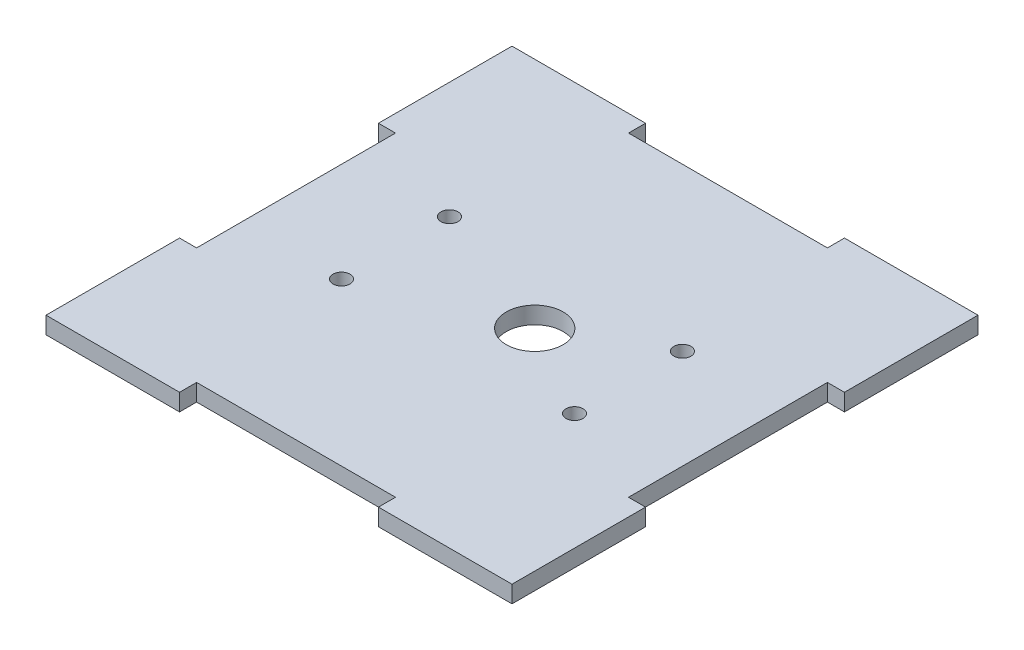
ISO-10303-21;
HEADER;
FILE_DESCRIPTION(('STEP AP214'),'2;1');
FILE_NAME('part.step','',(''),(''),'','','');
FILE_SCHEMA(('AUTOMOTIVE_DESIGN { 1 0 10303 214 1 1 1 1 }'));
ENDSEC;
DATA;
#1=APPLICATION_CONTEXT('core data for automotive mechanical design processes');
#2=APPLICATION_PROTOCOL_DEFINITION('international standard','automotive_design',2000,#1);
#3=PRODUCT_CONTEXT('',#1,'mechanical');
#4=PRODUCT('Part','Part','',(#3));
#5=PRODUCT_RELATED_PRODUCT_CATEGORY('part','',(#4));
#6=PRODUCT_DEFINITION_FORMATION('','',#4);
#7=PRODUCT_DEFINITION_CONTEXT('part definition',#1,'design');
#8=PRODUCT_DEFINITION('design','',#6,#7);
#9=PRODUCT_DEFINITION_SHAPE('','',#8);
#10=(LENGTH_UNIT() NAMED_UNIT(*) SI_UNIT(.MILLI.,.METRE.));
#11=(NAMED_UNIT(*) PLANE_ANGLE_UNIT() SI_UNIT($,.RADIAN.));
#12=(NAMED_UNIT(*) SI_UNIT($,.STERADIAN.) SOLID_ANGLE_UNIT());
#13=UNCERTAINTY_MEASURE_WITH_UNIT(LENGTH_MEASURE(1.E-05),#10,'distance_accuracy_value','');
#14=(GEOMETRIC_REPRESENTATION_CONTEXT(3) GLOBAL_UNCERTAINTY_ASSIGNED_CONTEXT((#13)) GLOBAL_UNIT_ASSIGNED_CONTEXT((#10,
#11,#12)) REPRESENTATION_CONTEXT('',''));
#15=CARTESIAN_POINT('',(0.,0.,0.));
#16=DIRECTION('',(0.,0.,1.));
#17=DIRECTION('',(1.,0.,0.));
#18=AXIS2_PLACEMENT_3D('',#15,#16,#17);
#19=CARTESIAN_POINT('',(41.,3.,-17.5));
#20=DIRECTION('',(-1.,0.,0.));
#21=DIRECTION('',(0.,0.,1.));
#22=AXIS2_PLACEMENT_3D('',#19,#20,#21);
#23=PLANE('',#22);
#24=DIRECTION('',(0.,0.,-1.));
#25=VECTOR('',#24,1.);
#26=CARTESIAN_POINT('',(41.,0.,-17.5));
#27=LINE('',#26,#25);
#28=CARTESIAN_POINT('',(41.,0.,-17.5));
#29=VERTEX_POINT('',#28);
#30=CARTESIAN_POINT('',(41.,0.,-41.));
#31=VERTEX_POINT('',#30);
#32=EDGE_CURVE('E211',#29,#31,#27,.T.);
#33=ORIENTED_EDGE('',*,*,#32,.T.);
#34=DIRECTION('',(0.,-1.,0.));
#35=VECTOR('',#34,1.);
#36=CARTESIAN_POINT('',(41.,3.,-41.));
#37=LINE('',#36,#35);
#38=CARTESIAN_POINT('',(41.,3.,-41.));
#39=VERTEX_POINT('',#38);
#40=EDGE_CURVE('E11',#39,#31,#37,.T.);
#41=ORIENTED_EDGE('',*,*,#40,.F.);
#42=DIRECTION('',(0.,0.,-1.));
#43=VECTOR('',#42,1.);
#44=CARTESIAN_POINT('',(41.,3.,-17.5));
#45=LINE('',#44,#43);
#46=CARTESIAN_POINT('',(41.,3.,-17.5));
#47=VERTEX_POINT('',#46);
#48=EDGE_CURVE('E270',#47,#39,#45,.T.);
#49=ORIENTED_EDGE('',*,*,#48,.F.);
#50=DIRECTION('',(0.,-1.,0.));
#51=VECTOR('',#50,1.);
#52=CARTESIAN_POINT('',(41.,3.,-17.5));
#53=LINE('',#52,#51);
#54=EDGE_CURVE('E207',#47,#29,#53,.T.);
#55=ORIENTED_EDGE('',*,*,#54,.T.);
#56=EDGE_LOOP('',(#33,#41,#49,#55));
#57=FACE_BOUND('',#56,.T.);
#58=ADVANCED_FACE('F38',(#57),#23,.F.);
#59=CARTESIAN_POINT('',(17.5,3.,-41.));
#60=DIRECTION('',(0.,0.,1.));
#61=DIRECTION('',(1.,0.,0.));
#62=AXIS2_PLACEMENT_3D('',#59,#60,#61);
#63=PLANE('',#62);
#64=DIRECTION('',(-1.,0.,0.));
#65=VECTOR('',#64,1.);
#66=CARTESIAN_POINT('',(17.5,0.,-41.));
#67=LINE('',#66,#65);
#68=CARTESIAN_POINT('',(17.5,0.,-41.));
#69=VERTEX_POINT('',#68);
#70=EDGE_CURVE('E215',#31,#69,#67,.T.);
#71=ORIENTED_EDGE('',*,*,#70,.T.);
#72=DIRECTION('',(0.,-1.,0.));
#73=VECTOR('',#72,1.);
#74=CARTESIAN_POINT('',(17.5,3.,-41.));
#75=LINE('',#74,#73);
#76=CARTESIAN_POINT('',(17.5,3.,-41.));
#77=VERTEX_POINT('',#76);
#78=EDGE_CURVE('E47',#77,#69,#75,.T.);
#79=ORIENTED_EDGE('',*,*,#78,.F.);
#80=DIRECTION('',(-1.,0.,0.));
#81=VECTOR('',#80,1.);
#82=CARTESIAN_POINT('',(17.5,3.,-41.));
#83=LINE('',#82,#81);
#84=EDGE_CURVE('E134',#39,#77,#83,.T.);
#85=ORIENTED_EDGE('',*,*,#84,.F.);
#86=ORIENTED_EDGE('',*,*,#40,.T.);
#87=EDGE_LOOP('',(#71,#79,#85,#86));
#88=FACE_BOUND('',#87,.T.);
#89=ADVANCED_FACE('F421',(#88),#63,.F.);
#90=CARTESIAN_POINT('',(17.5,3.,-38.));
#91=DIRECTION('',(1.,0.,0.));
#92=DIRECTION('',(0.,0.,-1.));
#93=AXIS2_PLACEMENT_3D('',#90,#91,#92);
#94=PLANE('',#93);
#95=DIRECTION('',(0.,0.,1.));
#96=VECTOR('',#95,1.);
#97=CARTESIAN_POINT('',(17.5,0.,-38.));
#98=LINE('',#97,#96);
#99=CARTESIAN_POINT('',(17.5,0.,-38.));
#100=VERTEX_POINT('',#99);
#101=EDGE_CURVE('E219',#69,#100,#98,.T.);
#102=ORIENTED_EDGE('',*,*,#101,.T.);
#103=DIRECTION('',(0.,-1.,0.));
#104=VECTOR('',#103,1.);
#105=CARTESIAN_POINT('',(17.5,3.,-38.));
#106=LINE('',#105,#104);
#107=CARTESIAN_POINT('',(17.5,3.,-38.));
#108=VERTEX_POINT('',#107);
#109=EDGE_CURVE('E329',#108,#100,#106,.T.);
#110=ORIENTED_EDGE('',*,*,#109,.F.);
#111=DIRECTION('',(0.,0.,1.));
#112=VECTOR('',#111,1.);
#113=CARTESIAN_POINT('',(17.5,3.,-38.));
#114=LINE('',#113,#112);
#115=EDGE_CURVE('E339',#77,#108,#114,.T.);
#116=ORIENTED_EDGE('',*,*,#115,.F.);
#117=ORIENTED_EDGE('',*,*,#78,.T.);
#118=EDGE_LOOP('',(#102,#110,#116,#117));
#119=FACE_BOUND('',#118,.T.);
#120=ADVANCED_FACE('F337',(#119),#94,.F.);
#121=CARTESIAN_POINT('',(-17.5,3.,-38.));
#122=DIRECTION('',(0.,0.,1.));
#123=DIRECTION('',(1.,0.,0.));
#124=AXIS2_PLACEMENT_3D('',#121,#122,#123);
#125=PLANE('',#124);
#126=DIRECTION('',(-1.,0.,0.));
#127=VECTOR('',#126,1.);
#128=CARTESIAN_POINT('',(-17.5,0.,-38.));
#129=LINE('',#128,#127);
#130=CARTESIAN_POINT('',(-17.5,0.,-38.));
#131=VERTEX_POINT('',#130);
#132=EDGE_CURVE('E222',#100,#131,#129,.T.);
#133=ORIENTED_EDGE('',*,*,#132,.T.);
#134=DIRECTION('',(0.,-1.,0.));
#135=VECTOR('',#134,1.);
#136=CARTESIAN_POINT('',(-17.5,3.,-38.));
#137=LINE('',#136,#135);
#138=CARTESIAN_POINT('',(-17.5,3.,-38.));
#139=VERTEX_POINT('',#138);
#140=EDGE_CURVE('E325',#139,#131,#137,.T.);
#141=ORIENTED_EDGE('',*,*,#140,.F.);
#142=DIRECTION('',(-1.,0.,0.));
#143=VECTOR('',#142,1.);
#144=CARTESIAN_POINT('',(-17.5,3.,-38.));
#145=LINE('',#144,#143);
#146=EDGE_CURVE('E358',#108,#139,#145,.T.);
#147=ORIENTED_EDGE('',*,*,#146,.F.);
#148=ORIENTED_EDGE('',*,*,#109,.T.);
#149=EDGE_LOOP('',(#133,#141,#147,#148));
#150=FACE_BOUND('',#149,.T.);
#151=ADVANCED_FACE('F348',(#150),#125,.F.);
#152=CARTESIAN_POINT('',(-17.5,3.,-41.));
#153=DIRECTION('',(-1.,0.,0.));
#154=DIRECTION('',(0.,0.,1.));
#155=AXIS2_PLACEMENT_3D('',#152,#153,#154);
#156=PLANE('',#155);
#157=DIRECTION('',(0.,0.,-1.));
#158=VECTOR('',#157,1.);
#159=CARTESIAN_POINT('',(-17.5,0.,-41.));
#160=LINE('',#159,#158);
#161=CARTESIAN_POINT('',(-17.5,0.,-41.));
#162=VERTEX_POINT('',#161);
#163=EDGE_CURVE('E225',#131,#162,#160,.T.);
#164=ORIENTED_EDGE('',*,*,#163,.T.);
#165=DIRECTION('',(0.,-1.,0.));
#166=VECTOR('',#165,1.);
#167=CARTESIAN_POINT('',(-17.5,3.,-41.));
#168=LINE('',#167,#166);
#169=CARTESIAN_POINT('',(-17.5,3.,-41.));
#170=VERTEX_POINT('',#169);
#171=EDGE_CURVE('E321',#170,#162,#168,.T.);
#172=ORIENTED_EDGE('',*,*,#171,.F.);
#173=DIRECTION('',(0.,0.,-1.));
#174=VECTOR('',#173,1.);
#175=CARTESIAN_POINT('',(-17.5,3.,-41.));
#176=LINE('',#175,#174);
#177=EDGE_CURVE('E354',#139,#170,#176,.T.);
#178=ORIENTED_EDGE('',*,*,#177,.F.);
#179=ORIENTED_EDGE('',*,*,#140,.T.);
#180=EDGE_LOOP('',(#164,#172,#178,#179));
#181=FACE_BOUND('',#180,.T.);
#182=ADVANCED_FACE('F352',(#181),#156,.F.);
#183=CARTESIAN_POINT('',(-41.,3.,-41.));
#184=DIRECTION('',(0.,0.,1.));
#185=DIRECTION('',(1.,0.,0.));
#186=AXIS2_PLACEMENT_3D('',#183,#184,#185);
#187=PLANE('',#186);
#188=DIRECTION('',(-1.,0.,0.));
#189=VECTOR('',#188,1.);
#190=CARTESIAN_POINT('',(-41.,0.,-41.));
#191=LINE('',#190,#189);
#192=CARTESIAN_POINT('',(-41.,0.,-41.));
#193=VERTEX_POINT('',#192);
#194=EDGE_CURVE('E228',#162,#193,#191,.T.);
#195=ORIENTED_EDGE('',*,*,#194,.T.);
#196=DIRECTION('',(0.,-1.,0.));
#197=VECTOR('',#196,1.);
#198=CARTESIAN_POINT('',(-41.,3.,-41.));
#199=LINE('',#198,#197);
#200=CARTESIAN_POINT('',(-41.,3.,-41.));
#201=VERTEX_POINT('',#200);
#202=EDGE_CURVE('E317',#201,#193,#199,.T.);
#203=ORIENTED_EDGE('',*,*,#202,.F.);
#204=DIRECTION('',(-1.,0.,0.));
#205=VECTOR('',#204,1.);
#206=CARTESIAN_POINT('',(-41.,3.,-41.));
#207=LINE('',#206,#205);
#208=EDGE_CURVE('E357',#170,#201,#207,.T.);
#209=ORIENTED_EDGE('',*,*,#208,.F.);
#210=ORIENTED_EDGE('',*,*,#171,.T.);
#211=EDGE_LOOP('',(#195,#203,#209,#210));
#212=FACE_BOUND('',#211,.T.);
#213=ADVANCED_FACE('F434',(#212),#187,.F.);
#214=CARTESIAN_POINT('',(-41.,3.,-17.5));
#215=DIRECTION('',(1.,0.,0.));
#216=DIRECTION('',(0.,0.,-1.));
#217=AXIS2_PLACEMENT_3D('',#214,#215,#216);
#218=PLANE('',#217);
#219=DIRECTION('',(0.,0.,1.));
#220=VECTOR('',#219,1.);
#221=CARTESIAN_POINT('',(-41.,0.,-17.5));
#222=LINE('',#221,#220);
#223=CARTESIAN_POINT('',(-41.,0.,-17.5));
#224=VERTEX_POINT('',#223);
#225=EDGE_CURVE('E231',#193,#224,#222,.T.);
#226=ORIENTED_EDGE('',*,*,#225,.T.);
#227=DIRECTION('',(0.,-1.,0.));
#228=VECTOR('',#227,1.);
#229=CARTESIAN_POINT('',(-41.,3.,-17.5));
#230=LINE('',#229,#228);
#231=CARTESIAN_POINT('',(-41.,3.,-17.5));
#232=VERTEX_POINT('',#231);
#233=EDGE_CURVE('E313',#232,#224,#230,.T.);
#234=ORIENTED_EDGE('',*,*,#233,.F.);
#235=DIRECTION('',(0.,0.,1.));
#236=VECTOR('',#235,1.);
#237=CARTESIAN_POINT('',(-41.,3.,-17.5));
#238=LINE('',#237,#236);
#239=EDGE_CURVE('E362',#201,#232,#238,.T.);
#240=ORIENTED_EDGE('',*,*,#239,.F.);
#241=ORIENTED_EDGE('',*,*,#202,.T.);
#242=EDGE_LOOP('',(#226,#234,#240,#241));
#243=FACE_BOUND('',#242,.T.);
#244=ADVANCED_FACE('F437',(#243),#218,.F.);
#245=CARTESIAN_POINT('',(-41.,3.,-17.5));
#246=DIRECTION('',(0.,0.,-1.));
#247=DIRECTION('',(-1.,0.,0.));
#248=AXIS2_PLACEMENT_3D('',#245,#246,#247);
#249=PLANE('',#248);
#250=DIRECTION('',(1.,0.,0.));
#251=VECTOR('',#250,1.);
#252=CARTESIAN_POINT('',(-41.,0.,-17.5));
#253=LINE('',#252,#251);
#254=CARTESIAN_POINT('',(-38.,0.,-17.5));
#255=VERTEX_POINT('',#254);
#256=EDGE_CURVE('E234',#224,#255,#253,.T.);
#257=ORIENTED_EDGE('',*,*,#256,.T.);
#258=DIRECTION('',(0.,-1.,0.));
#259=VECTOR('',#258,1.);
#260=CARTESIAN_POINT('',(-38.,3.,-17.5));
#261=LINE('',#260,#259);
#262=CARTESIAN_POINT('',(-38.,3.,-17.5));
#263=VERTEX_POINT('',#262);
#264=EDGE_CURVE('E309',#263,#255,#261,.T.);
#265=ORIENTED_EDGE('',*,*,#264,.F.);
#266=DIRECTION('',(1.,0.,0.));
#267=VECTOR('',#266,1.);
#268=CARTESIAN_POINT('',(-41.,3.,-17.5));
#269=LINE('',#268,#267);
#270=EDGE_CURVE('E369',#232,#263,#269,.T.);
#271=ORIENTED_EDGE('',*,*,#270,.F.);
#272=ORIENTED_EDGE('',*,*,#233,.T.);
#273=EDGE_LOOP('',(#257,#265,#271,#272));
#274=FACE_BOUND('',#273,.T.);
#275=ADVANCED_FACE('F441',(#274),#249,.F.);
#276=CARTESIAN_POINT('',(-38.,3.,-17.5));
#277=DIRECTION('',(1.,0.,0.));
#278=DIRECTION('',(0.,0.,-1.));
#279=AXIS2_PLACEMENT_3D('',#276,#277,#278);
#280=PLANE('',#279);
#281=DIRECTION('',(0.,0.,1.));
#282=VECTOR('',#281,1.);
#283=CARTESIAN_POINT('',(-38.,0.,-17.5));
#284=LINE('',#283,#282);
#285=CARTESIAN_POINT('',(-38.,0.,17.5));
#286=VERTEX_POINT('',#285);
#287=EDGE_CURVE('E237',#255,#286,#284,.T.);
#288=ORIENTED_EDGE('',*,*,#287,.T.);
#289=DIRECTION('',(0.,-1.,0.));
#290=VECTOR('',#289,1.);
#291=CARTESIAN_POINT('',(-38.,3.,17.5));
#292=LINE('',#291,#290);
#293=CARTESIAN_POINT('',(-38.,3.,17.5));
#294=VERTEX_POINT('',#293);
#295=EDGE_CURVE('E305',#294,#286,#292,.T.);
#296=ORIENTED_EDGE('',*,*,#295,.F.);
#297=DIRECTION('',(0.,0.,1.));
#298=VECTOR('',#297,1.);
#299=CARTESIAN_POINT('',(-38.,3.,-17.5));
#300=LINE('',#299,#298);
#301=EDGE_CURVE('E372',#263,#294,#300,.T.);
#302=ORIENTED_EDGE('',*,*,#301,.F.);
#303=ORIENTED_EDGE('',*,*,#264,.T.);
#304=EDGE_LOOP('',(#288,#296,#302,#303));
#305=FACE_BOUND('',#304,.T.);
#306=ADVANCED_FACE('F445',(#305),#280,.F.);
#307=CARTESIAN_POINT('',(-38.,3.,17.5));
#308=DIRECTION('',(0.,0.,1.));
#309=DIRECTION('',(1.,0.,0.));
#310=AXIS2_PLACEMENT_3D('',#307,#308,#309);
#311=PLANE('',#310);
#312=DIRECTION('',(-1.,0.,0.));
#313=VECTOR('',#312,1.);
#314=CARTESIAN_POINT('',(-38.,0.,17.5));
#315=LINE('',#314,#313);
#316=CARTESIAN_POINT('',(-41.,0.,17.5));
#317=VERTEX_POINT('',#316);
#318=EDGE_CURVE('E240',#286,#317,#315,.T.);
#319=ORIENTED_EDGE('',*,*,#318,.T.);
#320=DIRECTION('',(0.,-1.,0.));
#321=VECTOR('',#320,1.);
#322=CARTESIAN_POINT('',(-41.,3.,17.5));
#323=LINE('',#322,#321);
#324=CARTESIAN_POINT('',(-41.,3.,17.5));
#325=VERTEX_POINT('',#324);
#326=EDGE_CURVE('E301',#325,#317,#323,.T.);
#327=ORIENTED_EDGE('',*,*,#326,.F.);
#328=DIRECTION('',(-1.,0.,0.));
#329=VECTOR('',#328,1.);
#330=CARTESIAN_POINT('',(-38.,3.,17.5));
#331=LINE('',#330,#329);
#332=EDGE_CURVE('E375',#294,#325,#331,.T.);
#333=ORIENTED_EDGE('',*,*,#332,.F.);
#334=ORIENTED_EDGE('',*,*,#295,.T.);
#335=EDGE_LOOP('',(#319,#327,#333,#334));
#336=FACE_BOUND('',#335,.T.);
#337=ADVANCED_FACE('F449',(#336),#311,.F.);
#338=CARTESIAN_POINT('',(-41.,3.,41.));
#339=DIRECTION('',(1.,0.,0.));
#340=DIRECTION('',(0.,0.,-1.));
#341=AXIS2_PLACEMENT_3D('',#338,#339,#340);
#342=PLANE('',#341);
#343=DIRECTION('',(0.,0.,1.));
#344=VECTOR('',#343,1.);
#345=CARTESIAN_POINT('',(-41.,0.,41.));
#346=LINE('',#345,#344);
#347=CARTESIAN_POINT('',(-41.,0.,41.));
#348=VERTEX_POINT('',#347);
#349=EDGE_CURVE('E243',#317,#348,#346,.T.);
#350=ORIENTED_EDGE('',*,*,#349,.T.);
#351=DIRECTION('',(0.,-1.,0.));
#352=VECTOR('',#351,1.);
#353=CARTESIAN_POINT('',(-41.,3.,41.));
#354=LINE('',#353,#352);
#355=CARTESIAN_POINT('',(-41.,3.,41.));
#356=VERTEX_POINT('',#355);
#357=EDGE_CURVE('E297',#356,#348,#354,.T.);
#358=ORIENTED_EDGE('',*,*,#357,.F.);
#359=DIRECTION('',(0.,0.,1.));
#360=VECTOR('',#359,1.);
#361=CARTESIAN_POINT('',(-41.,3.,41.));
#362=LINE('',#361,#360);
#363=EDGE_CURVE('E378',#325,#356,#362,.T.);
#364=ORIENTED_EDGE('',*,*,#363,.F.);
#365=ORIENTED_EDGE('',*,*,#326,.T.);
#366=EDGE_LOOP('',(#350,#358,#364,#365));
#367=FACE_BOUND('',#366,.T.);
#368=ADVANCED_FACE('F453',(#367),#342,.F.);
#369=CARTESIAN_POINT('',(-41.,3.,41.));
#370=DIRECTION('',(0.,0.,-1.));
#371=DIRECTION('',(-1.,0.,0.));
#372=AXIS2_PLACEMENT_3D('',#369,#370,#371);
#373=PLANE('',#372);
#374=DIRECTION('',(1.,0.,0.));
#375=VECTOR('',#374,1.);
#376=CARTESIAN_POINT('',(-41.,0.,41.));
#377=LINE('',#376,#375);
#378=CARTESIAN_POINT('',(-17.5,0.,41.));
#379=VERTEX_POINT('',#378);
#380=EDGE_CURVE('E246',#348,#379,#377,.T.);
#381=ORIENTED_EDGE('',*,*,#380,.T.);
#382=DIRECTION('',(0.,-1.,0.));
#383=VECTOR('',#382,1.);
#384=CARTESIAN_POINT('',(-17.5,3.,41.));
#385=LINE('',#384,#383);
#386=CARTESIAN_POINT('',(-17.5,3.,41.));
#387=VERTEX_POINT('',#386);
#388=EDGE_CURVE('E293',#387,#379,#385,.T.);
#389=ORIENTED_EDGE('',*,*,#388,.F.);
#390=DIRECTION('',(1.,0.,0.));
#391=VECTOR('',#390,1.);
#392=CARTESIAN_POINT('',(-41.,3.,41.));
#393=LINE('',#392,#391);
#394=EDGE_CURVE('E381',#356,#387,#393,.T.);
#395=ORIENTED_EDGE('',*,*,#394,.F.);
#396=ORIENTED_EDGE('',*,*,#357,.T.);
#397=EDGE_LOOP('',(#381,#389,#395,#396));
#398=FACE_BOUND('',#397,.T.);
#399=ADVANCED_FACE('F457',(#398),#373,.F.);
#400=CARTESIAN_POINT('',(-17.5,3.,38.));
#401=DIRECTION('',(-1.,0.,0.));
#402=DIRECTION('',(0.,0.,1.));
#403=AXIS2_PLACEMENT_3D('',#400,#401,#402);
#404=PLANE('',#403);
#405=DIRECTION('',(0.,0.,-1.));
#406=VECTOR('',#405,1.);
#407=CARTESIAN_POINT('',(-17.5,0.,38.));
#408=LINE('',#407,#406);
#409=CARTESIAN_POINT('',(-17.5,0.,38.));
#410=VERTEX_POINT('',#409);
#411=EDGE_CURVE('E249',#379,#410,#408,.T.);
#412=ORIENTED_EDGE('',*,*,#411,.T.);
#413=DIRECTION('',(0.,-1.,0.));
#414=VECTOR('',#413,1.);
#415=CARTESIAN_POINT('',(-17.5,3.,38.));
#416=LINE('',#415,#414);
#417=CARTESIAN_POINT('',(-17.5,3.,38.));
#418=VERTEX_POINT('',#417);
#419=EDGE_CURVE('E289',#418,#410,#416,.T.);
#420=ORIENTED_EDGE('',*,*,#419,.F.);
#421=DIRECTION('',(0.,0.,-1.));
#422=VECTOR('',#421,1.);
#423=CARTESIAN_POINT('',(-17.5,3.,38.));
#424=LINE('',#423,#422);
#425=EDGE_CURVE('E384',#387,#418,#424,.T.);
#426=ORIENTED_EDGE('',*,*,#425,.F.);
#427=ORIENTED_EDGE('',*,*,#388,.T.);
#428=EDGE_LOOP('',(#412,#420,#426,#427));
#429=FACE_BOUND('',#428,.T.);
#430=ADVANCED_FACE('F461',(#429),#404,.F.);
#431=CARTESIAN_POINT('',(17.5,3.,38.));
#432=DIRECTION('',(0.,0.,-1.));
#433=DIRECTION('',(-1.,0.,0.));
#434=AXIS2_PLACEMENT_3D('',#431,#432,#433);
#435=PLANE('',#434);
#436=DIRECTION('',(1.,0.,0.));
#437=VECTOR('',#436,1.);
#438=CARTESIAN_POINT('',(17.5,0.,38.));
#439=LINE('',#438,#437);
#440=CARTESIAN_POINT('',(17.5,0.,38.));
#441=VERTEX_POINT('',#440);
#442=EDGE_CURVE('E252',#410,#441,#439,.T.);
#443=ORIENTED_EDGE('',*,*,#442,.T.);
#444=DIRECTION('',(0.,-1.,0.));
#445=VECTOR('',#444,1.);
#446=CARTESIAN_POINT('',(17.5,3.,38.));
#447=LINE('',#446,#445);
#448=CARTESIAN_POINT('',(17.5,3.,38.));
#449=VERTEX_POINT('',#448);
#450=EDGE_CURVE('E285',#449,#441,#447,.T.);
#451=ORIENTED_EDGE('',*,*,#450,.F.);
#452=DIRECTION('',(1.,0.,0.));
#453=VECTOR('',#452,1.);
#454=CARTESIAN_POINT('',(17.5,3.,38.));
#455=LINE('',#454,#453);
#456=EDGE_CURVE('E387',#418,#449,#455,.T.);
#457=ORIENTED_EDGE('',*,*,#456,.F.);
#458=ORIENTED_EDGE('',*,*,#419,.T.);
#459=EDGE_LOOP('',(#443,#451,#457,#458));
#460=FACE_BOUND('',#459,.T.);
#461=ADVANCED_FACE('F465',(#460),#435,.F.);
#462=CARTESIAN_POINT('',(17.5,3.,41.));
#463=DIRECTION('',(1.,0.,0.));
#464=DIRECTION('',(0.,0.,-1.));
#465=AXIS2_PLACEMENT_3D('',#462,#463,#464);
#466=PLANE('',#465);
#467=DIRECTION('',(0.,0.,1.));
#468=VECTOR('',#467,1.);
#469=CARTESIAN_POINT('',(17.5,0.,41.));
#470=LINE('',#469,#468);
#471=CARTESIAN_POINT('',(17.5,0.,41.));
#472=VERTEX_POINT('',#471);
#473=EDGE_CURVE('E255',#441,#472,#470,.T.);
#474=ORIENTED_EDGE('',*,*,#473,.T.);
#475=DIRECTION('',(0.,-1.,0.));
#476=VECTOR('',#475,1.);
#477=CARTESIAN_POINT('',(17.5,3.,41.));
#478=LINE('',#477,#476);
#479=CARTESIAN_POINT('',(17.5,3.,41.));
#480=VERTEX_POINT('',#479);
#481=EDGE_CURVE('E281',#480,#472,#478,.T.);
#482=ORIENTED_EDGE('',*,*,#481,.F.);
#483=DIRECTION('',(0.,0.,1.));
#484=VECTOR('',#483,1.);
#485=CARTESIAN_POINT('',(17.5,3.,41.));
#486=LINE('',#485,#484);
#487=EDGE_CURVE('E390',#449,#480,#486,.T.);
#488=ORIENTED_EDGE('',*,*,#487,.F.);
#489=ORIENTED_EDGE('',*,*,#450,.T.);
#490=EDGE_LOOP('',(#474,#482,#488,#489));
#491=FACE_BOUND('',#490,.T.);
#492=ADVANCED_FACE('F469',(#491),#466,.F.);
#493=CARTESIAN_POINT('',(17.5,3.,41.));
#494=DIRECTION('',(0.,0.,-1.));
#495=DIRECTION('',(-1.,0.,0.));
#496=AXIS2_PLACEMENT_3D('',#493,#494,#495);
#497=PLANE('',#496);
#498=DIRECTION('',(1.,0.,0.));
#499=VECTOR('',#498,1.);
#500=CARTESIAN_POINT('',(17.5,0.,41.));
#501=LINE('',#500,#499);
#502=CARTESIAN_POINT('',(41.,0.,41.));
#503=VERTEX_POINT('',#502);
#504=EDGE_CURVE('E258',#472,#503,#501,.T.);
#505=ORIENTED_EDGE('',*,*,#504,.T.);
#506=DIRECTION('',(0.,-1.,0.));
#507=VECTOR('',#506,1.);
#508=CARTESIAN_POINT('',(41.,3.,41.));
#509=LINE('',#508,#507);
#510=CARTESIAN_POINT('',(41.,3.,41.));
#511=VERTEX_POINT('',#510);
#512=EDGE_CURVE('E277',#511,#503,#509,.T.);
#513=ORIENTED_EDGE('',*,*,#512,.F.);
#514=DIRECTION('',(1.,0.,0.));
#515=VECTOR('',#514,1.);
#516=CARTESIAN_POINT('',(17.5,3.,41.));
#517=LINE('',#516,#515);
#518=EDGE_CURVE('E393',#480,#511,#517,.T.);
#519=ORIENTED_EDGE('',*,*,#518,.F.);
#520=ORIENTED_EDGE('',*,*,#481,.T.);
#521=EDGE_LOOP('',(#505,#513,#519,#520));
#522=FACE_BOUND('',#521,.T.);
#523=ADVANCED_FACE('F401',(#522),#497,.F.);
#524=CARTESIAN_POINT('',(41.,3.,41.));
#525=DIRECTION('',(-1.,0.,0.));
#526=DIRECTION('',(0.,0.,1.));
#527=AXIS2_PLACEMENT_3D('',#524,#525,#526);
#528=PLANE('',#527);
#529=DIRECTION('',(0.,0.,-1.));
#530=VECTOR('',#529,1.);
#531=CARTESIAN_POINT('',(41.,0.,41.));
#532=LINE('',#531,#530);
#533=CARTESIAN_POINT('',(41.,0.,17.5));
#534=VERTEX_POINT('',#533);
#535=EDGE_CURVE('E261',#503,#534,#532,.T.);
#536=ORIENTED_EDGE('',*,*,#535,.T.);
#537=DIRECTION('',(0.,-1.,0.));
#538=VECTOR('',#537,1.);
#539=CARTESIAN_POINT('',(41.,3.,17.5));
#540=LINE('',#539,#538);
#541=CARTESIAN_POINT('',(41.,3.,17.5));
#542=VERTEX_POINT('',#541);
#543=EDGE_CURVE('E200',#542,#534,#540,.T.);
#544=ORIENTED_EDGE('',*,*,#543,.F.);
#545=DIRECTION('',(0.,0.,-1.));
#546=VECTOR('',#545,1.);
#547=CARTESIAN_POINT('',(41.,3.,41.));
#548=LINE('',#547,#546);
#549=EDGE_CURVE('E189',#511,#542,#548,.T.);
#550=ORIENTED_EDGE('',*,*,#549,.F.);
#551=ORIENTED_EDGE('',*,*,#512,.T.);
#552=EDGE_LOOP('',(#536,#544,#550,#551));
#553=FACE_BOUND('',#552,.T.);
#554=ADVANCED_FACE('F405',(#553),#528,.F.);
#555=CARTESIAN_POINT('',(38.,3.,17.5));
#556=DIRECTION('',(0.,0.,1.));
#557=DIRECTION('',(1.,0.,0.));
#558=AXIS2_PLACEMENT_3D('',#555,#556,#557);
#559=PLANE('',#558);
#560=DIRECTION('',(-1.,0.,0.));
#561=VECTOR('',#560,1.);
#562=CARTESIAN_POINT('',(38.,0.,17.5));
#563=LINE('',#562,#561);
#564=CARTESIAN_POINT('',(38.,0.,17.5));
#565=VERTEX_POINT('',#564);
#566=EDGE_CURVE('E198',#534,#565,#563,.T.);
#567=ORIENTED_EDGE('',*,*,#566,.T.);
#568=DIRECTION('',(0.,-1.,0.));
#569=VECTOR('',#568,1.);
#570=CARTESIAN_POINT('',(38.,3.,17.5));
#571=LINE('',#570,#569);
#572=CARTESIAN_POINT('',(38.,3.,17.5));
#573=VERTEX_POINT('',#572);
#574=EDGE_CURVE('E195',#573,#565,#571,.T.);
#575=ORIENTED_EDGE('',*,*,#574,.F.);
#576=DIRECTION('',(-1.,0.,0.));
#577=VECTOR('',#576,1.);
#578=CARTESIAN_POINT('',(38.,3.,17.5));
#579=LINE('',#578,#577);
#580=EDGE_CURVE('E183',#542,#573,#579,.T.);
#581=ORIENTED_EDGE('',*,*,#580,.F.);
#582=ORIENTED_EDGE('',*,*,#543,.T.);
#583=EDGE_LOOP('',(#567,#575,#581,#582));
#584=FACE_BOUND('',#583,.T.);
#585=ADVANCED_FACE('F196',(#584),#559,.F.);
#586=CARTESIAN_POINT('',(38.,3.,-17.5));
#587=DIRECTION('',(-1.,0.,0.));
#588=DIRECTION('',(0.,0.,1.));
#589=AXIS2_PLACEMENT_3D('',#586,#587,#588);
#590=PLANE('',#589);
#591=DIRECTION('',(0.,0.,-1.));
#592=VECTOR('',#591,1.);
#593=CARTESIAN_POINT('',(38.,0.,-17.5));
#594=LINE('',#593,#592);
#595=CARTESIAN_POINT('',(38.,0.,-17.5));
#596=VERTEX_POINT('',#595);
#597=EDGE_CURVE('E120',#565,#596,#594,.T.);
#598=ORIENTED_EDGE('',*,*,#597,.T.);
#599=DIRECTION('',(0.,-1.,0.));
#600=VECTOR('',#599,1.);
#601=CARTESIAN_POINT('',(38.,3.,-17.5));
#602=LINE('',#601,#600);
#603=CARTESIAN_POINT('',(38.,3.,-17.5));
#604=VERTEX_POINT('',#603);
#605=EDGE_CURVE('E201',#604,#596,#602,.T.);
#606=ORIENTED_EDGE('',*,*,#605,.F.);
#607=DIRECTION('',(0.,0.,-1.));
#608=VECTOR('',#607,1.);
#609=CARTESIAN_POINT('',(38.,3.,-17.5));
#610=LINE('',#609,#608);
#611=EDGE_CURVE('E187',#573,#604,#610,.T.);
#612=ORIENTED_EDGE('',*,*,#611,.F.);
#613=ORIENTED_EDGE('',*,*,#574,.T.);
#614=EDGE_LOOP('',(#598,#606,#612,#613));
#615=FACE_BOUND('',#614,.T.);
#616=ADVANCED_FACE('F203',(#615),#590,.F.);
#617=CARTESIAN_POINT('',(41.,3.,-17.5));
#618=DIRECTION('',(0.,0.,-1.));
#619=DIRECTION('',(-1.,0.,0.));
#620=AXIS2_PLACEMENT_3D('',#617,#618,#619);
#621=PLANE('',#620);
#622=DIRECTION('',(1.,0.,0.));
#623=VECTOR('',#622,1.);
#624=CARTESIAN_POINT('',(41.,0.,-17.5));
#625=LINE('',#624,#623);
#626=EDGE_CURVE('E126',#596,#29,#625,.T.);
#627=ORIENTED_EDGE('',*,*,#626,.T.);
#628=ORIENTED_EDGE('',*,*,#54,.F.);
#629=DIRECTION('',(1.,0.,0.));
#630=VECTOR('',#629,1.);
#631=CARTESIAN_POINT('',(41.,3.,-17.5));
#632=LINE('',#631,#630);
#633=EDGE_CURVE('E55',#604,#47,#632,.T.);
#634=ORIENTED_EDGE('',*,*,#633,.F.);
#635=ORIENTED_EDGE('',*,*,#605,.T.);
#636=EDGE_LOOP('',(#627,#628,#634,#635));
#637=FACE_BOUND('',#636,.T.);
#638=ADVANCED_FACE('F409',(#637),#621,.F.);
#639=CARTESIAN_POINT('',(0.,3.,0.));
#640=DIRECTION('',(0.,-1.,0.));
#641=DIRECTION('',(0.,0.,-1.));
#642=AXIS2_PLACEMENT_3D('',#639,#640,#641);
#643=PLANE('',#642);
#644=CARTESIAN_POINT('',(20.5,3.,-9.5));
#645=DIRECTION('',(0.,1.,0.));
#646=DIRECTION('',(0.,0.,-1.));
#647=AXIS2_PLACEMENT_3D('',#644,#645,#646);
#648=CIRCLE('',#647,1.5);
#649=CARTESIAN_POINT('',(20.5,3.,-11.));
#650=VERTEX_POINT('',#649);
#651=EDGE_CURVE('E565',#650,#650,#648,.T.);
#652=ORIENTED_EDGE('',*,*,#651,.F.);
#653=EDGE_LOOP('',(#652));
#654=FACE_BOUND('',#653,.T.);
#655=CARTESIAN_POINT('',(20.5,3.,9.5));
#656=DIRECTION('',(0.,1.,0.));
#657=DIRECTION('',(0.,0.,1.));
#658=AXIS2_PLACEMENT_3D('',#655,#656,#657);
#659=CIRCLE('',#658,1.5);
#660=CARTESIAN_POINT('',(20.5,3.,11.));
#661=VERTEX_POINT('',#660);
#662=EDGE_CURVE('E569',#661,#661,#659,.T.);
#663=ORIENTED_EDGE('',*,*,#662,.F.);
#664=EDGE_LOOP('',(#663));
#665=FACE_BOUND('',#664,.T.);
#666=CARTESIAN_POINT('',(-20.5,3.,9.5));
#667=DIRECTION('',(0.,1.,0.));
#668=DIRECTION('',(0.,0.,-1.));
#669=AXIS2_PLACEMENT_3D('',#666,#667,#668);
#670=CIRCLE('',#669,1.5);
#671=CARTESIAN_POINT('',(-20.5,3.,8.));
#672=VERTEX_POINT('',#671);
#673=EDGE_CURVE('E596',#672,#672,#670,.T.);
#674=ORIENTED_EDGE('',*,*,#673,.F.);
#675=EDGE_LOOP('',(#674));
#676=FACE_BOUND('',#675,.T.);
#677=CARTESIAN_POINT('',(-20.5,3.,-9.5));
#678=DIRECTION('',(0.,1.,0.));
#679=DIRECTION('',(0.,0.,1.));
#680=AXIS2_PLACEMENT_3D('',#677,#678,#679);
#681=CIRCLE('',#680,1.5);
#682=CARTESIAN_POINT('',(-20.5,3.,-8.));
#683=VERTEX_POINT('',#682);
#684=EDGE_CURVE('E588',#683,#683,#681,.T.);
#685=ORIENTED_EDGE('',*,*,#684,.F.);
#686=EDGE_LOOP('',(#685));
#687=FACE_BOUND('',#686,.T.);
#688=CARTESIAN_POINT('',(4.,3.,0.));
#689=DIRECTION('',(0.,1.,0.));
#690=DIRECTION('',(0.,0.,1.));
#691=AXIS2_PLACEMENT_3D('',#688,#689,#690);
#692=CIRCLE('',#691,5.);
#693=CARTESIAN_POINT('',(4.,3.,5.));
#694=VERTEX_POINT('',#693);
#695=EDGE_CURVE('E576',#694,#694,#692,.T.);
#696=ORIENTED_EDGE('',*,*,#695,.F.);
#697=EDGE_LOOP('',(#696));
#698=FACE_BOUND('',#697,.T.);
#699=ORIENTED_EDGE('',*,*,#48,.T.);
#700=ORIENTED_EDGE('',*,*,#84,.T.);
#701=ORIENTED_EDGE('',*,*,#115,.T.);
#702=ORIENTED_EDGE('',*,*,#146,.T.);
#703=ORIENTED_EDGE('',*,*,#177,.T.);
#704=ORIENTED_EDGE('',*,*,#208,.T.);
#705=ORIENTED_EDGE('',*,*,#239,.T.);
#706=ORIENTED_EDGE('',*,*,#270,.T.);
#707=ORIENTED_EDGE('',*,*,#301,.T.);
#708=ORIENTED_EDGE('',*,*,#332,.T.);
#709=ORIENTED_EDGE('',*,*,#363,.T.);
#710=ORIENTED_EDGE('',*,*,#394,.T.);
#711=ORIENTED_EDGE('',*,*,#425,.T.);
#712=ORIENTED_EDGE('',*,*,#456,.T.);
#713=ORIENTED_EDGE('',*,*,#487,.T.);
#714=ORIENTED_EDGE('',*,*,#518,.T.);
#715=ORIENTED_EDGE('',*,*,#549,.T.);
#716=ORIENTED_EDGE('',*,*,#580,.T.);
#717=ORIENTED_EDGE('',*,*,#611,.T.);
#718=ORIENTED_EDGE('',*,*,#633,.T.);
#719=EDGE_LOOP('',(#699,#700,#701,#702,#703,#704,#705,#706,#707,#708,#709,#710,#711,#712,#713,
#714,#715,#716,#717,#718));
#720=FACE_BOUND('',#719,.T.);
#721=ADVANCED_FACE('F185',(#654,#665,#676,#687,#698,#720),#643,.F.);
#722=CARTESIAN_POINT('',(0.,0.,0.));
#723=DIRECTION('',(0.,-1.,0.));
#724=DIRECTION('',(0.,0.,-1.));
#725=AXIS2_PLACEMENT_3D('',#722,#723,#724);
#726=PLANE('',#725);
#727=CARTESIAN_POINT('',(20.5,0.,-9.5));
#728=DIRECTION('',(0.,1.,0.));
#729=DIRECTION('',(0.,0.,-1.));
#730=AXIS2_PLACEMENT_3D('',#727,#728,#729);
#731=CIRCLE('',#730,1.5);
#732=CARTESIAN_POINT('',(20.5,0.,-11.));
#733=VERTEX_POINT('',#732);
#734=EDGE_CURVE('E562',#733,#733,#731,.T.);
#735=ORIENTED_EDGE('',*,*,#734,.T.);
#736=EDGE_LOOP('',(#735));
#737=FACE_BOUND('',#736,.T.);
#738=CARTESIAN_POINT('',(20.5,0.,9.5));
#739=DIRECTION('',(0.,1.,0.));
#740=DIRECTION('',(0.,0.,1.));
#741=AXIS2_PLACEMENT_3D('',#738,#739,#740);
#742=CIRCLE('',#741,1.5);
#743=CARTESIAN_POINT('',(20.5,0.,11.));
#744=VERTEX_POINT('',#743);
#745=EDGE_CURVE('E600',#744,#744,#742,.T.);
#746=ORIENTED_EDGE('',*,*,#745,.T.);
#747=EDGE_LOOP('',(#746));
#748=FACE_BOUND('',#747,.T.);
#749=CARTESIAN_POINT('',(-20.5,0.,9.5));
#750=DIRECTION('',(0.,1.,0.));
#751=DIRECTION('',(0.,0.,-1.));
#752=AXIS2_PLACEMENT_3D('',#749,#750,#751);
#753=CIRCLE('',#752,1.5);
#754=CARTESIAN_POINT('',(-20.5,0.,8.));
#755=VERTEX_POINT('',#754);
#756=EDGE_CURVE('E592',#755,#755,#753,.T.);
#757=ORIENTED_EDGE('',*,*,#756,.T.);
#758=EDGE_LOOP('',(#757));
#759=FACE_BOUND('',#758,.T.);
#760=CARTESIAN_POINT('',(-20.5,0.,-9.5));
#761=DIRECTION('',(0.,1.,0.));
#762=DIRECTION('',(0.,0.,1.));
#763=AXIS2_PLACEMENT_3D('',#760,#761,#762);
#764=CIRCLE('',#763,1.5);
#765=CARTESIAN_POINT('',(-20.5,0.,-8.));
#766=VERTEX_POINT('',#765);
#767=EDGE_CURVE('E580',#766,#766,#764,.T.);
#768=ORIENTED_EDGE('',*,*,#767,.T.);
#769=EDGE_LOOP('',(#768));
#770=FACE_BOUND('',#769,.T.);
#771=CARTESIAN_POINT('',(4.,0.,0.));
#772=DIRECTION('',(0.,1.,0.));
#773=DIRECTION('',(0.,0.,1.));
#774=AXIS2_PLACEMENT_3D('',#771,#772,#773);
#775=CIRCLE('',#774,5.);
#776=CARTESIAN_POINT('',(4.,0.,5.));
#777=VERTEX_POINT('',#776);
#778=EDGE_CURVE('E216',#777,#777,#775,.T.);
#779=ORIENTED_EDGE('',*,*,#778,.T.);
#780=EDGE_LOOP('',(#779));
#781=FACE_BOUND('',#780,.T.);
#782=ORIENTED_EDGE('',*,*,#32,.F.);
#783=ORIENTED_EDGE('',*,*,#626,.F.);
#784=ORIENTED_EDGE('',*,*,#597,.F.);
#785=ORIENTED_EDGE('',*,*,#566,.F.);
#786=ORIENTED_EDGE('',*,*,#535,.F.);
#787=ORIENTED_EDGE('',*,*,#504,.F.);
#788=ORIENTED_EDGE('',*,*,#473,.F.);
#789=ORIENTED_EDGE('',*,*,#442,.F.);
#790=ORIENTED_EDGE('',*,*,#411,.F.);
#791=ORIENTED_EDGE('',*,*,#380,.F.);
#792=ORIENTED_EDGE('',*,*,#349,.F.);
#793=ORIENTED_EDGE('',*,*,#318,.F.);
#794=ORIENTED_EDGE('',*,*,#287,.F.);
#795=ORIENTED_EDGE('',*,*,#256,.F.);
#796=ORIENTED_EDGE('',*,*,#225,.F.);
#797=ORIENTED_EDGE('',*,*,#194,.F.);
#798=ORIENTED_EDGE('',*,*,#163,.F.);
#799=ORIENTED_EDGE('',*,*,#132,.F.);
#800=ORIENTED_EDGE('',*,*,#101,.F.);
#801=ORIENTED_EDGE('',*,*,#70,.F.);
#802=EDGE_LOOP('',(#782,#783,#784,#785,#786,#787,#788,#789,#790,#791,#792,#793,#794,#795,#796,
#797,#798,#799,#800,#801));
#803=FACE_BOUND('',#802,.T.);
#804=ADVANCED_FACE('F343',(#737,#748,#759,#770,#781,#803),#726,.T.);
#805=CARTESIAN_POINT('',(4.,0.,0.));
#806=DIRECTION('',(0.,1.,0.));
#807=DIRECTION('',(0.,0.,1.));
#808=AXIS2_PLACEMENT_3D('',#805,#806,#807);
#809=CYLINDRICAL_SURFACE('',#808,5.);
#810=ORIENTED_EDGE('',*,*,#778,.F.);
#811=EDGE_LOOP('',(#810));
#812=FACE_BOUND('',#811,.T.);
#813=ORIENTED_EDGE('',*,*,#695,.T.);
#814=EDGE_LOOP('',(#813));
#815=FACE_BOUND('',#814,.T.);
#816=ADVANCED_FACE('F506',(#812,#815),#809,.F.);
#817=CARTESIAN_POINT('',(-20.5,0.,-9.5));
#818=DIRECTION('',(0.,1.,0.));
#819=DIRECTION('',(0.,0.,1.));
#820=AXIS2_PLACEMENT_3D('',#817,#818,#819);
#821=CYLINDRICAL_SURFACE('',#820,1.5);
#822=ORIENTED_EDGE('',*,*,#767,.F.);
#823=EDGE_LOOP('',(#822));
#824=FACE_BOUND('',#823,.T.);
#825=ORIENTED_EDGE('',*,*,#684,.T.);
#826=EDGE_LOOP('',(#825));
#827=FACE_BOUND('',#826,.T.);
#828=ADVANCED_FACE('F515',(#824,#827),#821,.F.);
#829=CARTESIAN_POINT('',(-20.5,0.,9.5));
#830=DIRECTION('',(0.,1.,0.));
#831=DIRECTION('',(0.,0.,1.));
#832=AXIS2_PLACEMENT_3D('',#829,#830,#831);
#833=CYLINDRICAL_SURFACE('',#832,1.5);
#834=ORIENTED_EDGE('',*,*,#756,.F.);
#835=EDGE_LOOP('',(#834));
#836=FACE_BOUND('',#835,.T.);
#837=ORIENTED_EDGE('',*,*,#673,.T.);
#838=EDGE_LOOP('',(#837));
#839=FACE_BOUND('',#838,.T.);
#840=ADVANCED_FACE('F525',(#836,#839),#833,.F.);
#841=CARTESIAN_POINT('',(20.5,0.,9.5));
#842=DIRECTION('',(0.,1.,0.));
#843=DIRECTION('',(0.,0.,1.));
#844=AXIS2_PLACEMENT_3D('',#841,#842,#843);
#845=CYLINDRICAL_SURFACE('',#844,1.5);
#846=ORIENTED_EDGE('',*,*,#745,.F.);
#847=EDGE_LOOP('',(#846));
#848=FACE_BOUND('',#847,.T.);
#849=ORIENTED_EDGE('',*,*,#662,.T.);
#850=EDGE_LOOP('',(#849));
#851=FACE_BOUND('',#850,.T.);
#852=ADVANCED_FACE('F535',(#848,#851),#845,.F.);
#853=CARTESIAN_POINT('',(20.5,0.,-9.5));
#854=DIRECTION('',(0.,1.,0.));
#855=DIRECTION('',(0.,0.,1.));
#856=AXIS2_PLACEMENT_3D('',#853,#854,#855);
#857=CYLINDRICAL_SURFACE('',#856,1.5);
#858=ORIENTED_EDGE('',*,*,#734,.F.);
#859=EDGE_LOOP('',(#858));
#860=FACE_BOUND('',#859,.T.);
#861=ORIENTED_EDGE('',*,*,#651,.T.);
#862=EDGE_LOOP('',(#861));
#863=FACE_BOUND('',#862,.T.);
#864=ADVANCED_FACE('F545',(#860,#863),#857,.F.);
#865=CLOSED_SHELL('',(#58,#89,#120,#151,#182,#213,#244,#275,#306,#337,#368,#399,#430,#461,#492,
#523,#554,#585,#616,#638,#721,#804,#816,#828,#840,#852,#864));
#866=MANIFOLD_SOLID_BREP('B2',#865);
#867=ADVANCED_BREP_SHAPE_REPRESENTATION('',(#18,#866),#14);
#868=SHAPE_DEFINITION_REPRESENTATION(#9,#867);
ENDSEC;
END-ISO-10303-21;
